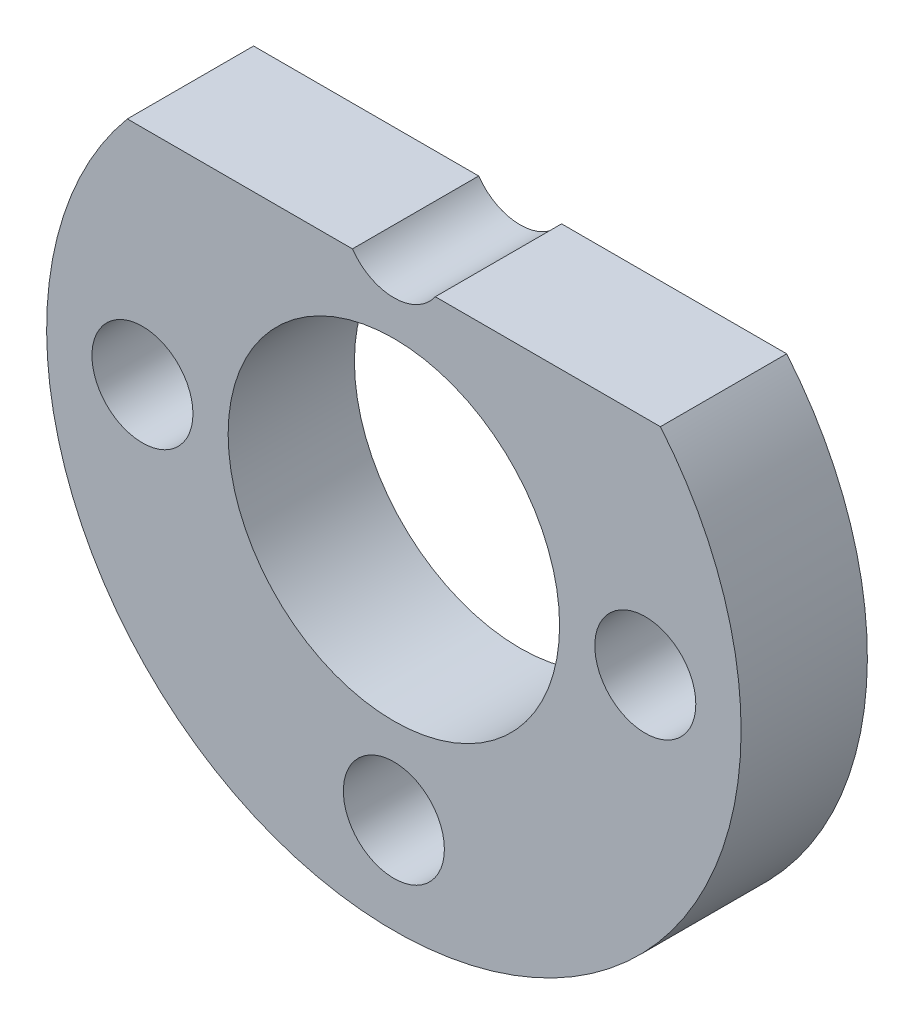
ISO-10303-21;
HEADER;
FILE_DESCRIPTION(('STEP AP214'),'2;1');
FILE_NAME('part.step','',(''),(''),'','','');
FILE_SCHEMA(('AUTOMOTIVE_DESIGN { 1 0 10303 214 1 1 1 1 }'));
ENDSEC;
DATA;
#1=APPLICATION_CONTEXT('core data for automotive mechanical design processes');
#2=APPLICATION_PROTOCOL_DEFINITION('international standard','automotive_design',2000,#1);
#3=PRODUCT_CONTEXT('',#1,'mechanical');
#4=PRODUCT('Part','Part','',(#3));
#5=PRODUCT_RELATED_PRODUCT_CATEGORY('part','',(#4));
#6=PRODUCT_DEFINITION_FORMATION('','',#4);
#7=PRODUCT_DEFINITION_CONTEXT('part definition',#1,'design');
#8=PRODUCT_DEFINITION('design','',#6,#7);
#9=PRODUCT_DEFINITION_SHAPE('','',#8);
#10=(LENGTH_UNIT() NAMED_UNIT(*) SI_UNIT(.MILLI.,.METRE.));
#11=(NAMED_UNIT(*) PLANE_ANGLE_UNIT() SI_UNIT($,.RADIAN.));
#12=(NAMED_UNIT(*) SI_UNIT($,.STERADIAN.) SOLID_ANGLE_UNIT());
#13=UNCERTAINTY_MEASURE_WITH_UNIT(LENGTH_MEASURE(1.E-05),#10,'distance_accuracy_value','');
#14=(GEOMETRIC_REPRESENTATION_CONTEXT(3) GLOBAL_UNCERTAINTY_ASSIGNED_CONTEXT((#13)) GLOBAL_UNIT_ASSIGNED_CONTEXT((#10,
#11,#12)) REPRESENTATION_CONTEXT('',''));
#15=CARTESIAN_POINT('',(0.,0.,0.));
#16=DIRECTION('',(0.,0.,1.));
#17=DIRECTION('',(1.,0.,0.));
#18=AXIS2_PLACEMENT_3D('',#15,#16,#17);
#19=CARTESIAN_POINT('',(95.2028085271053,-295.7159331995,4.));
#20=DIRECTION('',(0.,-1.,0.));
#21=DIRECTION('',(0.,0.,-1.));
#22=AXIS2_PLACEMENT_3D('',#19,#20,#21);
#23=PLANE('',#22);
#24=DIRECTION('',(-1.,0.,0.));
#25=VECTOR('',#24,1.);
#26=CARTESIAN_POINT('',(95.2028085271053,-295.7159331995,0.));
#27=LINE('',#26,#25);
#28=CARTESIAN_POINT('',(112.090377920005,-295.7159331995,0.));
#29=VERTEX_POINT('',#28);
#30=CARTESIAN_POINT('',(104.95933145547,-295.7159331995,0.));
#31=VERTEX_POINT('',#30);
#32=EDGE_CURVE('E82',#29,#31,#27,.T.);
#33=ORIENTED_EDGE('',*,*,#32,.T.);
#34=DIRECTION('',(0.,0.,1.));
#35=VECTOR('',#34,1.);
#36=CARTESIAN_POINT('',(104.95933145547,-295.7159331995,4.));
#37=LINE('',#36,#35);
#38=CARTESIAN_POINT('',(104.95933145547,-295.7159331995,4.));
#39=VERTEX_POINT('',#38);
#40=EDGE_CURVE('E50',#31,#39,#37,.T.);
#41=ORIENTED_EDGE('',*,*,#40,.T.);
#42=DIRECTION('',(-1.,0.,0.));
#43=VECTOR('',#42,1.);
#44=CARTESIAN_POINT('',(95.2028085271053,-295.7159331995,4.));
#45=LINE('',#44,#43);
#46=CARTESIAN_POINT('',(112.090377920005,-295.7159331995,4.));
#47=VERTEX_POINT('',#46);
#48=EDGE_CURVE('E89',#47,#39,#45,.T.);
#49=ORIENTED_EDGE('',*,*,#48,.F.);
#50=DIRECTION('',(0.,0.,-1.));
#51=VECTOR('',#50,1.);
#52=CARTESIAN_POINT('',(112.090377920005,-295.7159331995,4.));
#53=LINE('',#52,#51);
#54=EDGE_CURVE('E11',#47,#29,#53,.T.);
#55=ORIENTED_EDGE('',*,*,#54,.T.);
#56=EDGE_LOOP('',(#33,#41,#49,#55));
#57=FACE_BOUND('',#56,.T.);
#58=ADVANCED_FACE('F35',(#57),#23,.F.);
#59=CARTESIAN_POINT('',(103.646593223555,-302.7659331995,4.));
#60=DIRECTION('',(0.,0.,-1.));
#61=DIRECTION('',(-1.,0.,0.));
#62=AXIS2_PLACEMENT_3D('',#59,#60,#61);
#63=CYLINDRICAL_SURFACE('',#62,11.);
#64=CARTESIAN_POINT('',(103.646593223555,-302.7659331995,0.));
#65=DIRECTION('',(0.,0.,1.));
#66=DIRECTION('',(1.,0.,0.));
#67=AXIS2_PLACEMENT_3D('',#64,#65,#66);
#68=CIRCLE('',#67,11.);
#69=CARTESIAN_POINT('',(95.2028085271053,-295.7159331995,0.));
#70=VERTEX_POINT('',#69);
#71=EDGE_CURVE('E83',#70,#29,#68,.T.);
#72=ORIENTED_EDGE('',*,*,#71,.T.);
#73=ORIENTED_EDGE('',*,*,#54,.F.);
#74=CARTESIAN_POINT('',(103.646593223555,-302.7659331995,4.));
#75=DIRECTION('',(0.,0.,1.));
#76=DIRECTION('',(1.,0.,0.));
#77=AXIS2_PLACEMENT_3D('',#74,#75,#76);
#78=CIRCLE('',#77,11.);
#79=CARTESIAN_POINT('',(95.2028085271053,-295.7159331995,4.));
#80=VERTEX_POINT('',#79);
#81=EDGE_CURVE('E88',#80,#47,#78,.T.);
#82=ORIENTED_EDGE('',*,*,#81,.F.);
#83=DIRECTION('',(0.,0.,-1.));
#84=VECTOR('',#83,1.);
#85=CARTESIAN_POINT('',(95.2028085271053,-295.7159331995,4.));
#86=LINE('',#85,#84);
#87=EDGE_CURVE('E43',#80,#70,#86,.T.);
#88=ORIENTED_EDGE('',*,*,#87,.T.);
#89=EDGE_LOOP('',(#72,#73,#82,#88));
#90=FACE_BOUND('',#89,.T.);
#91=ADVANCED_FACE('F37',(#90),#63,.T.);
#92=CARTESIAN_POINT('',(102.333854991646,-295.7159331995,4.));
#93=VERTEX_POINT('',#92);
#94=EDGE_CURVE('E59',#93,#80,#45,.T.);
#95=ORIENTED_EDGE('',*,*,#94,.F.);
#96=DIRECTION('',(0.,0.,1.));
#97=VECTOR('',#96,1.);
#98=CARTESIAN_POINT('',(102.333854991646,-295.7159331995,4.));
#99=LINE('',#98,#97);
#100=CARTESIAN_POINT('',(102.333854991646,-295.7159331995,0.));
#101=VERTEX_POINT('',#100);
#102=EDGE_CURVE('E79',#93,#101,#99,.F.);
#103=ORIENTED_EDGE('',*,*,#102,.T.);
#104=EDGE_CURVE('E73',#101,#70,#27,.T.);
#105=ORIENTED_EDGE('',*,*,#104,.T.);
#106=ORIENTED_EDGE('',*,*,#87,.F.);
#107=EDGE_LOOP('',(#95,#103,#105,#106));
#108=FACE_BOUND('',#107,.T.);
#109=ADVANCED_FACE('F75',(#108),#23,.F.);
#110=CARTESIAN_POINT('',(103.646593223555,-302.7659331995,4.));
#111=DIRECTION('',(0.,0.,1.));
#112=DIRECTION('',(1.,0.,0.));
#113=AXIS2_PLACEMENT_3D('',#110,#111,#112);
#114=PLANE('',#113);
#115=CARTESIAN_POINT('',(95.6818701318656,-302.765933199499,4.));
#116=DIRECTION('',(0.,0.,1.));
#117=DIRECTION('',(1.,0.,0.));
#118=AXIS2_PLACEMENT_3D('',#115,#116,#117);
#119=CIRCLE('',#118,1.59999999999999);
#120=CARTESIAN_POINT('',(97.2818701318656,-302.765933199499,4.));
#121=VERTEX_POINT('',#120);
#122=EDGE_CURVE('E125',#121,#121,#119,.T.);
#123=ORIENTED_EDGE('',*,*,#122,.F.);
#124=EDGE_LOOP('',(#123));
#125=FACE_BOUND('',#124,.T.);
#126=CARTESIAN_POINT('',(111.61131631525,-302.765933199499,4.));
#127=DIRECTION('',(0.,0.,1.));
#128=DIRECTION('',(1.,0.,0.));
#129=AXIS2_PLACEMENT_3D('',#126,#127,#128);
#130=CIRCLE('',#129,1.59999999999999);
#131=CARTESIAN_POINT('',(113.21131631525,-302.765933199499,4.));
#132=VERTEX_POINT('',#131);
#133=EDGE_CURVE('E119',#132,#132,#130,.T.);
#134=ORIENTED_EDGE('',*,*,#133,.F.);
#135=EDGE_LOOP('',(#134));
#136=FACE_BOUND('',#135,.T.);
#137=CARTESIAN_POINT('',(103.646593223558,-310.730656291191,4.));
#138=DIRECTION('',(0.,0.,1.));
#139=DIRECTION('',(1.,0.,0.));
#140=AXIS2_PLACEMENT_3D('',#137,#138,#139);
#141=CIRCLE('',#140,1.59999999999999);
#142=CARTESIAN_POINT('',(105.246593223558,-310.730656291191,4.));
#143=VERTEX_POINT('',#142);
#144=EDGE_CURVE('E113',#143,#143,#141,.T.);
#145=ORIENTED_EDGE('',*,*,#144,.F.);
#146=EDGE_LOOP('',(#145));
#147=FACE_BOUND('',#146,.T.);
#148=CARTESIAN_POINT('',(103.646593223558,-294.801210107807,4.));
#149=DIRECTION('',(0.,0.,1.));
#150=DIRECTION('',(1.,0.,0.));
#151=AXIS2_PLACEMENT_3D('',#148,#149,#150);
#152=CIRCLE('',#151,1.59999999999999);
#153=EDGE_CURVE('E108',#93,#39,#152,.T.);
#154=ORIENTED_EDGE('',*,*,#153,.F.);
#155=ORIENTED_EDGE('',*,*,#94,.T.);
#156=ORIENTED_EDGE('',*,*,#81,.T.);
#157=ORIENTED_EDGE('',*,*,#48,.T.);
#158=EDGE_LOOP('',(#154,#155,#156,#157));
#159=FACE_BOUND('',#158,.T.);
#160=CARTESIAN_POINT('',(103.646593223555,-302.7659331995,4.));
#161=DIRECTION('',(0.,0.,1.));
#162=DIRECTION('',(1.,0.,0.));
#163=AXIS2_PLACEMENT_3D('',#160,#161,#162);
#164=CIRCLE('',#163,5.25);
#165=CARTESIAN_POINT('',(108.896593223555,-302.7659331995,4.));
#166=VERTEX_POINT('',#165);
#167=EDGE_CURVE('E95',#166,#166,#164,.T.);
#168=ORIENTED_EDGE('',*,*,#167,.F.);
#169=EDGE_LOOP('',(#168));
#170=FACE_BOUND('',#169,.T.);
#171=ADVANCED_FACE('F131',(#125,#136,#147,#159,#170),#114,.T.);
#172=CARTESIAN_POINT('',(103.646593223555,-302.7659331995,0.));
#173=DIRECTION('',(0.,0.,1.));
#174=DIRECTION('',(1.,0.,0.));
#175=AXIS2_PLACEMENT_3D('',#172,#173,#174);
#176=PLANE('',#175);
#177=CARTESIAN_POINT('',(95.6818701318656,-302.765933199499,0.));
#178=DIRECTION('',(0.,0.,1.));
#179=DIRECTION('',(1.,0.,0.));
#180=AXIS2_PLACEMENT_3D('',#177,#178,#179);
#181=CIRCLE('',#180,1.6);
#182=CARTESIAN_POINT('',(97.2818701318656,-302.765933199499,0.));
#183=VERTEX_POINT('',#182);
#184=EDGE_CURVE('E122',#183,#183,#181,.T.);
#185=ORIENTED_EDGE('',*,*,#184,.T.);
#186=EDGE_LOOP('',(#185));
#187=FACE_BOUND('',#186,.T.);
#188=CARTESIAN_POINT('',(111.61131631525,-302.765933199499,0.));
#189=DIRECTION('',(0.,0.,1.));
#190=DIRECTION('',(1.,0.,0.));
#191=AXIS2_PLACEMENT_3D('',#188,#189,#190);
#192=CIRCLE('',#191,1.6);
#193=CARTESIAN_POINT('',(113.21131631525,-302.765933199499,0.));
#194=VERTEX_POINT('',#193);
#195=EDGE_CURVE('E116',#194,#194,#192,.T.);
#196=ORIENTED_EDGE('',*,*,#195,.T.);
#197=EDGE_LOOP('',(#196));
#198=FACE_BOUND('',#197,.T.);
#199=CARTESIAN_POINT('',(103.646593223558,-310.730656291191,0.));
#200=DIRECTION('',(0.,0.,1.));
#201=DIRECTION('',(1.,0.,0.));
#202=AXIS2_PLACEMENT_3D('',#199,#200,#201);
#203=CIRCLE('',#202,1.6);
#204=CARTESIAN_POINT('',(105.246593223558,-310.730656291191,0.));
#205=VERTEX_POINT('',#204);
#206=EDGE_CURVE('E110',#205,#205,#203,.T.);
#207=ORIENTED_EDGE('',*,*,#206,.T.);
#208=EDGE_LOOP('',(#207));
#209=FACE_BOUND('',#208,.T.);
#210=CARTESIAN_POINT('',(103.646593223555,-302.7659331995,0.));
#211=DIRECTION('',(0.,0.,1.));
#212=DIRECTION('',(1.,0.,0.));
#213=AXIS2_PLACEMENT_3D('',#210,#211,#212);
#214=CIRCLE('',#213,5.25);
#215=CARTESIAN_POINT('',(108.896593223555,-302.7659331995,0.));
#216=VERTEX_POINT('',#215);
#217=EDGE_CURVE('E92',#216,#216,#214,.T.);
#218=ORIENTED_EDGE('',*,*,#217,.T.);
#219=EDGE_LOOP('',(#218));
#220=FACE_BOUND('',#219,.T.);
#221=ORIENTED_EDGE('',*,*,#104,.F.);
#222=CARTESIAN_POINT('',(103.646593223558,-294.801210107807,0.));
#223=DIRECTION('',(0.,0.,1.));
#224=DIRECTION('',(1.,0.,0.));
#225=AXIS2_PLACEMENT_3D('',#222,#223,#224);
#226=CIRCLE('',#225,1.6);
#227=EDGE_CURVE('E106',#101,#31,#226,.T.);
#228=ORIENTED_EDGE('',*,*,#227,.T.);
#229=ORIENTED_EDGE('',*,*,#32,.F.);
#230=ORIENTED_EDGE('',*,*,#71,.F.);
#231=EDGE_LOOP('',(#221,#228,#229,#230));
#232=FACE_BOUND('',#231,.T.);
#233=ADVANCED_FACE('F90',(#187,#198,#209,#220,#232),#176,.F.);
#234=CARTESIAN_POINT('',(103.646593223555,-302.7659331995,0.));
#235=DIRECTION('',(0.,0.,1.));
#236=DIRECTION('',(1.,0.,0.));
#237=AXIS2_PLACEMENT_3D('',#234,#235,#236);
#238=CYLINDRICAL_SURFACE('',#237,5.25);
#239=ORIENTED_EDGE('',*,*,#217,.F.);
#240=EDGE_LOOP('',(#239));
#241=FACE_BOUND('',#240,.T.);
#242=ORIENTED_EDGE('',*,*,#167,.T.);
#243=EDGE_LOOP('',(#242));
#244=FACE_BOUND('',#243,.T.);
#245=ADVANCED_FACE('F142',(#241,#244),#238,.F.);
#246=CARTESIAN_POINT('',(103.646593223558,-294.801210107807,4.));
#247=DIRECTION('',(0.,0.,1.));
#248=DIRECTION('',(1.,0.,0.));
#249=AXIS2_PLACEMENT_3D('',#246,#247,#248);
#250=CYLINDRICAL_SURFACE('',#249,1.6);
#251=ORIENTED_EDGE('',*,*,#227,.F.);
#252=ORIENTED_EDGE('',*,*,#102,.F.);
#253=ORIENTED_EDGE('',*,*,#153,.T.);
#254=ORIENTED_EDGE('',*,*,#40,.F.);
#255=EDGE_LOOP('',(#251,#252,#253,#254));
#256=FACE_BOUND('',#255,.T.);
#257=ADVANCED_FACE('F144',(#256),#250,.F.);
#258=CARTESIAN_POINT('',(103.646593223558,-310.730656291191,4.));
#259=DIRECTION('',(0.,0.,1.));
#260=DIRECTION('',(1.,0.,0.));
#261=AXIS2_PLACEMENT_3D('',#258,#259,#260);
#262=CYLINDRICAL_SURFACE('',#261,1.6);
#263=ORIENTED_EDGE('',*,*,#206,.F.);
#264=EDGE_LOOP('',(#263));
#265=FACE_BOUND('',#264,.T.);
#266=ORIENTED_EDGE('',*,*,#144,.T.);
#267=EDGE_LOOP('',(#266));
#268=FACE_BOUND('',#267,.T.);
#269=ADVANCED_FACE('F151',(#265,#268),#262,.F.);
#270=CARTESIAN_POINT('',(111.61131631525,-302.765933199499,4.));
#271=DIRECTION('',(0.,0.,1.));
#272=DIRECTION('',(1.,0.,0.));
#273=AXIS2_PLACEMENT_3D('',#270,#271,#272);
#274=CYLINDRICAL_SURFACE('',#273,1.6);
#275=ORIENTED_EDGE('',*,*,#195,.F.);
#276=EDGE_LOOP('',(#275));
#277=FACE_BOUND('',#276,.T.);
#278=ORIENTED_EDGE('',*,*,#133,.T.);
#279=EDGE_LOOP('',(#278));
#280=FACE_BOUND('',#279,.T.);
#281=ADVANCED_FACE('F190',(#277,#280),#274,.F.);
#282=CARTESIAN_POINT('',(95.6818701318656,-302.765933199499,4.));
#283=DIRECTION('',(0.,0.,1.));
#284=DIRECTION('',(1.,0.,0.));
#285=AXIS2_PLACEMENT_3D('',#282,#283,#284);
#286=CYLINDRICAL_SURFACE('',#285,1.6);
#287=ORIENTED_EDGE('',*,*,#184,.F.);
#288=EDGE_LOOP('',(#287));
#289=FACE_BOUND('',#288,.T.);
#290=ORIENTED_EDGE('',*,*,#122,.T.);
#291=EDGE_LOOP('',(#290));
#292=FACE_BOUND('',#291,.T.);
#293=ADVANCED_FACE('F129',(#289,#292),#286,.F.);
#294=CLOSED_SHELL('',(#58,#91,#109,#171,#233,#245,#257,#269,#281,#293));
#295=MANIFOLD_SOLID_BREP('B2',#294);
#296=ADVANCED_BREP_SHAPE_REPRESENTATION('',(#18,#295),#14);
#297=SHAPE_DEFINITION_REPRESENTATION(#9,#296);
ENDSEC;
END-ISO-10303-21;
